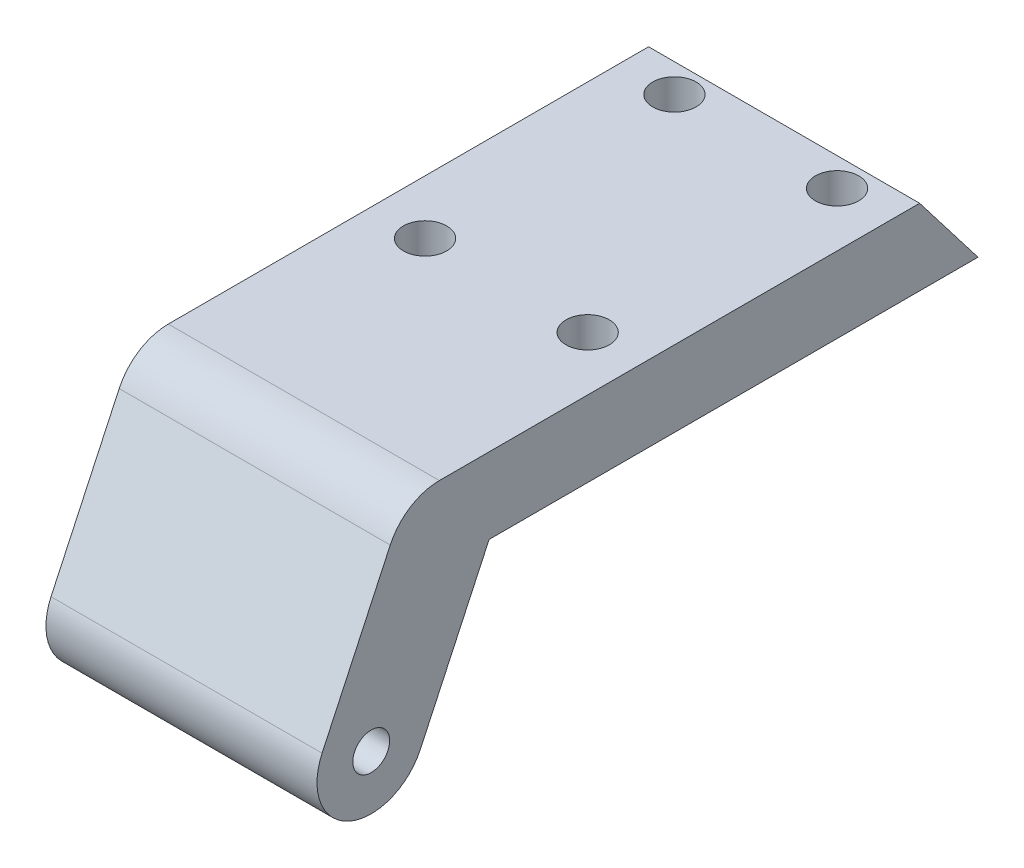
ISO-10303-21;
HEADER;
FILE_DESCRIPTION(('STEP AP214'),'2;1');
FILE_NAME('part.step','',(''),(''),'','','');
FILE_SCHEMA(('AUTOMOTIVE_DESIGN { 1 0 10303 214 1 1 1 1 }'));
ENDSEC;
DATA;
#1=APPLICATION_CONTEXT('core data for automotive mechanical design processes');
#2=APPLICATION_PROTOCOL_DEFINITION('international standard','automotive_design',2000,#1);
#3=PRODUCT_CONTEXT('',#1,'mechanical');
#4=PRODUCT('Part','Part','',(#3));
#5=PRODUCT_RELATED_PRODUCT_CATEGORY('part','',(#4));
#6=PRODUCT_DEFINITION_FORMATION('','',#4);
#7=PRODUCT_DEFINITION_CONTEXT('part definition',#1,'design');
#8=PRODUCT_DEFINITION('design','',#6,#7);
#9=PRODUCT_DEFINITION_SHAPE('','',#8);
#10=(LENGTH_UNIT() NAMED_UNIT(*) SI_UNIT(.MILLI.,.METRE.));
#11=(NAMED_UNIT(*) PLANE_ANGLE_UNIT() SI_UNIT($,.RADIAN.));
#12=(NAMED_UNIT(*) SI_UNIT($,.STERADIAN.) SOLID_ANGLE_UNIT());
#13=UNCERTAINTY_MEASURE_WITH_UNIT(LENGTH_MEASURE(1.E-05),#10,'distance_accuracy_value','');
#14=(GEOMETRIC_REPRESENTATION_CONTEXT(3) GLOBAL_UNCERTAINTY_ASSIGNED_CONTEXT((#13)) GLOBAL_UNIT_ASSIGNED_CONTEXT((#10,
#11,#12)) REPRESENTATION_CONTEXT('',''));
#15=CARTESIAN_POINT('',(0.,0.,0.));
#16=DIRECTION('',(0.,0.,1.));
#17=DIRECTION('',(1.,0.,0.));
#18=AXIS2_PLACEMENT_3D('',#15,#16,#17);
#19=CARTESIAN_POINT('',(1239.58557195285,7.,1588.21257215047));
#20=DIRECTION('',(1.,0.,0.));
#21=DIRECTION('',(0.,0.,-1.));
#22=AXIS2_PLACEMENT_3D('',#19,#20,#21);
#23=PLANE('',#22);
#24=DIRECTION('',(0.,-0.906307787036649,0.4226182617407));
#25=VECTOR('',#24,1.);
#26=CARTESIAN_POINT('',(1239.58557195285,7.,1647.09219773301));
#27=LINE('',#26,#25);
#28=CARTESIAN_POINT('',(1239.58557195285,4.11309130870354,1648.43838536415));
#29=VERTEX_POINT('',#28);
#30=CARTESIAN_POINT('',(1239.58557195285,-9.36843418814272,1654.72492394695));
#31=VERTEX_POINT('',#30);
#32=EDGE_CURVE('E94',#29,#31,#27,.T.);
#33=ORIENTED_EDGE('',*,*,#32,.F.);
#34=CARTESIAN_POINT('',(1239.58557195285,2.,1643.90684642897));
#35=DIRECTION('',(1.,0.,0.));
#36=DIRECTION('',(0.,0.,-1.));
#37=AXIS2_PLACEMENT_3D('',#34,#35,#36);
#38=CIRCLE('',#37,5.);
#39=CARTESIAN_POINT('',(1239.58557195285,7.,1643.90684642897));
#40=VERTEX_POINT('',#39);
#41=EDGE_CURVE('E11',#29,#40,#38,.F.);
#42=ORIENTED_EDGE('',*,*,#41,.T.);
#43=DIRECTION('',(0.,0.,1.));
#44=VECTOR('',#43,1.);
#45=CARTESIAN_POINT('',(1239.58557195285,7.,1588.21257215047));
#46=LINE('',#45,#44);
#47=CARTESIAN_POINT('',(1239.58557195285,7.,1599.61312730155));
#48=VERTEX_POINT('',#47);
#49=EDGE_CURVE('E155',#48,#40,#46,.T.);
#50=ORIENTED_EDGE('',*,*,#49,.F.);
#51=DIRECTION('',(0.,-0.792774884248765,-0.609514546917756));
#52=VECTOR('',#51,1.);
#53=CARTESIAN_POINT('',(1239.58557195285,1.49116254871517,1595.37773005338));
#54=LINE('',#53,#52);
#55=CARTESIAN_POINT('',(1239.58557195285,0.,1594.23126933254));
#56=VERTEX_POINT('',#55);
#57=EDGE_CURVE('E151',#48,#56,#54,.T.);
#58=ORIENTED_EDGE('',*,*,#57,.T.);
#59=DIRECTION('',(0.,0.,1.));
#60=VECTOR('',#59,1.);
#61=CARTESIAN_POINT('',(1239.58557195285,0.,1588.21257215047));
#62=LINE('',#61,#60);
#63=CARTESIAN_POINT('',(1239.58557195285,0.,1639.32257215047));
#64=VERTEX_POINT('',#63);
#65=EDGE_CURVE('E154',#56,#64,#62,.T.);
#66=ORIENTED_EDGE('',*,*,#65,.T.);
#67=DIRECTION('',(0.,0.906307787036648,-0.422618261740703));
#68=VECTOR('',#67,1.);
#69=CARTESIAN_POINT('',(1239.58557195285,-13.5946168055497,1645.66184607658));
#70=LINE('',#69,#68);
#71=CARTESIAN_POINT('',(1239.58557195285,-13.5946168055497,1645.66184607658));
#72=VERTEX_POINT('',#71);
#73=EDGE_CURVE('E112',#72,#64,#70,.T.);
#74=ORIENTED_EDGE('',*,*,#73,.F.);
#75=CARTESIAN_POINT('',(1239.58557195285,-11.4815254968463,1650.19338501176));
#76=DIRECTION('',(1.,0.,0.));
#77=DIRECTION('',(0.,0.,-1.));
#78=AXIS2_PLACEMENT_3D('',#75,#76,#77);
#79=CIRCLE('',#78,5.00000000000007);
#80=EDGE_CURVE('E102',#31,#72,#79,.T.);
#81=ORIENTED_EDGE('',*,*,#80,.F.);
#82=EDGE_LOOP('',(#33,#42,#50,#58,#66,#74,#81));
#83=FACE_BOUND('',#82,.T.);
#84=CARTESIAN_POINT('',(1239.58557195285,-11.4815254968463,1650.19338501176));
#85=DIRECTION('',(1.,0.,0.));
#86=DIRECTION('',(0.,0.,-1.));
#87=AXIS2_PLACEMENT_3D('',#84,#85,#86);
#88=CIRCLE('',#87,1.69999999999996);
#89=CARTESIAN_POINT('',(1239.58557195285,-11.4815254968463,1648.49338501176));
#90=VERTEX_POINT('',#89);
#91=EDGE_CURVE('E123',#90,#90,#88,.T.);
#92=ORIENTED_EDGE('',*,*,#91,.T.);
#93=EDGE_LOOP('',(#92));
#94=FACE_BOUND('',#93,.T.);
#95=ADVANCED_FACE('F39',(#83,#94),#23,.F.);
#96=CARTESIAN_POINT('',(1264.58557195285,7.,1588.21257215047));
#97=DIRECTION('',(-1.,0.,0.));
#98=DIRECTION('',(0.,0.,1.));
#99=AXIS2_PLACEMENT_3D('',#96,#97,#98);
#100=PLANE('',#99);
#101=DIRECTION('',(0.,0.,-1.));
#102=VECTOR('',#101,1.);
#103=CARTESIAN_POINT('',(1264.58557195285,7.,1588.21257215047));
#104=LINE('',#103,#102);
#105=CARTESIAN_POINT('',(1264.58557195285,7.,1643.90684642897));
#106=VERTEX_POINT('',#105);
#107=CARTESIAN_POINT('',(1264.58557195285,7.,1599.61312730155));
#108=VERTEX_POINT('',#107);
#109=EDGE_CURVE('E158',#106,#108,#104,.T.);
#110=ORIENTED_EDGE('',*,*,#109,.F.);
#111=CARTESIAN_POINT('',(1264.58557195285,2.,1643.90684642897));
#112=DIRECTION('',(-1.,0.,0.));
#113=DIRECTION('',(0.,0.,1.));
#114=AXIS2_PLACEMENT_3D('',#111,#112,#113);
#115=CIRCLE('',#114,5.);
#116=CARTESIAN_POINT('',(1264.58557195285,4.11309130870354,1648.43838536415));
#117=VERTEX_POINT('',#116);
#118=EDGE_CURVE('E61',#106,#117,#115,.F.);
#119=ORIENTED_EDGE('',*,*,#118,.T.);
#120=DIRECTION('',(0.,-0.906307787036649,0.4226182617407));
#121=VECTOR('',#120,1.);
#122=CARTESIAN_POINT('',(1264.58557195285,7.,1647.09219773301));
#123=LINE('',#122,#121);
#124=CARTESIAN_POINT('',(1264.58557195285,-9.36843418814272,1654.72492394695));
#125=VERTEX_POINT('',#124);
#126=EDGE_CURVE('E121',#117,#125,#123,.T.);
#127=ORIENTED_EDGE('',*,*,#126,.T.);
#128=CARTESIAN_POINT('',(1264.58557195285,-11.4815254968463,1650.19338501176));
#129=DIRECTION('',(1.,0.,0.));
#130=DIRECTION('',(0.,0.,-1.));
#131=AXIS2_PLACEMENT_3D('',#128,#129,#130);
#132=CIRCLE('',#131,5.00000000000007);
#133=CARTESIAN_POINT('',(1264.58557195285,-13.5946168055497,1645.66184607658));
#134=VERTEX_POINT('',#133);
#135=EDGE_CURVE('E110',#125,#134,#132,.T.);
#136=ORIENTED_EDGE('',*,*,#135,.T.);
#137=DIRECTION('',(0.,0.906307787036648,-0.422618261740703));
#138=VECTOR('',#137,1.);
#139=CARTESIAN_POINT('',(1264.58557195285,-13.5946168055497,1645.66184607658));
#140=LINE('',#139,#138);
#141=CARTESIAN_POINT('',(1264.58557195285,0.,1639.32257215047));
#142=VERTEX_POINT('',#141);
#143=EDGE_CURVE('E103',#134,#142,#140,.T.);
#144=ORIENTED_EDGE('',*,*,#143,.T.);
#145=DIRECTION('',(0.,0.,-1.));
#146=VECTOR('',#145,1.);
#147=CARTESIAN_POINT('',(1264.58557195285,0.,1588.21257215047));
#148=LINE('',#147,#146);
#149=CARTESIAN_POINT('',(1264.58557195285,0.,1594.23126933254));
#150=VERTEX_POINT('',#149);
#151=EDGE_CURVE('E159',#142,#150,#148,.T.);
#152=ORIENTED_EDGE('',*,*,#151,.T.);
#153=DIRECTION('',(0.,-0.792774884248765,-0.609514546917756));
#154=VECTOR('',#153,1.);
#155=CARTESIAN_POINT('',(1264.58557195285,0.,1594.23126933254));
#156=LINE('',#155,#154);
#157=EDGE_CURVE('E144',#108,#150,#156,.T.);
#158=ORIENTED_EDGE('',*,*,#157,.F.);
#159=EDGE_LOOP('',(#110,#119,#127,#136,#144,#152,#158));
#160=FACE_BOUND('',#159,.T.);
#161=CARTESIAN_POINT('',(1264.58557195285,-11.4815254968463,1650.19338501176));
#162=DIRECTION('',(1.,0.,0.));
#163=DIRECTION('',(0.,0.,-1.));
#164=AXIS2_PLACEMENT_3D('',#161,#162,#163);
#165=CIRCLE('',#164,1.69999999999996);
#166=CARTESIAN_POINT('',(1264.58557195285,-11.4815254968463,1648.49338501176));
#167=VERTEX_POINT('',#166);
#168=EDGE_CURVE('E362',#167,#167,#165,.T.);
#169=ORIENTED_EDGE('',*,*,#168,.F.);
#170=EDGE_LOOP('',(#169));
#171=FACE_BOUND('',#170,.T.);
#172=ADVANCED_FACE('F186',(#160,#171),#100,.F.);
#173=CARTESIAN_POINT('',(0.,7.,0.));
#174=DIRECTION('',(0.,1.,0.));
#175=DIRECTION('',(0.,0.,1.));
#176=AXIS2_PLACEMENT_3D('',#173,#174,#175);
#177=PLANE('',#176);
#178=CARTESIAN_POINT('',(1259.58557195285,7.,1625.23126933254));
#179=DIRECTION('',(0.,1.,0.));
#180=DIRECTION('',(0.,0.,1.));
#181=AXIS2_PLACEMENT_3D('',#178,#179,#180);
#182=CIRCLE('',#181,1.99999999999989);
#183=CARTESIAN_POINT('',(1259.58557195285,7.,1627.23126933254));
#184=VERTEX_POINT('',#183);
#185=EDGE_CURVE('E135',#184,#184,#182,.T.);
#186=ORIENTED_EDGE('',*,*,#185,.F.);
#187=EDGE_LOOP('',(#186));
#188=FACE_BOUND('',#187,.T.);
#189=CARTESIAN_POINT('',(1244.58557195285,7.,1602.23126933254));
#190=DIRECTION('',(0.,1.,0.));
#191=DIRECTION('',(0.,0.,1.));
#192=AXIS2_PLACEMENT_3D('',#189,#190,#191);
#193=CIRCLE('',#192,1.99999999999989);
#194=CARTESIAN_POINT('',(1244.58557195285,7.,1604.23126933254));
#195=VERTEX_POINT('',#194);
#196=EDGE_CURVE('E134',#195,#195,#193,.T.);
#197=ORIENTED_EDGE('',*,*,#196,.F.);
#198=EDGE_LOOP('',(#197));
#199=FACE_BOUND('',#198,.T.);
#200=CARTESIAN_POINT('',(1244.58557195285,7.,1625.23126933254));
#201=DIRECTION('',(0.,1.,0.));
#202=DIRECTION('',(0.,0.,1.));
#203=AXIS2_PLACEMENT_3D('',#200,#201,#202);
#204=CIRCLE('',#203,1.99999999999989);
#205=CARTESIAN_POINT('',(1244.58557195285,7.,1627.23126933254));
#206=VERTEX_POINT('',#205);
#207=EDGE_CURVE('E130',#206,#206,#204,.T.);
#208=ORIENTED_EDGE('',*,*,#207,.F.);
#209=EDGE_LOOP('',(#208));
#210=FACE_BOUND('',#209,.T.);
#211=CARTESIAN_POINT('',(1259.58557195285,7.,1602.23126933254));
#212=DIRECTION('',(0.,1.,0.));
#213=DIRECTION('',(0.,0.,1.));
#214=AXIS2_PLACEMENT_3D('',#211,#212,#213);
#215=CIRCLE('',#214,1.99999999999989);
#216=CARTESIAN_POINT('',(1259.58557195285,7.,1604.23126933254));
#217=VERTEX_POINT('',#216);
#218=EDGE_CURVE('E138',#217,#217,#215,.T.);
#219=ORIENTED_EDGE('',*,*,#218,.F.);
#220=EDGE_LOOP('',(#219));
#221=FACE_BOUND('',#220,.T.);
#222=ORIENTED_EDGE('',*,*,#49,.T.);
#223=DIRECTION('',(1.,0.,0.));
#224=VECTOR('',#223,1.);
#225=CARTESIAN_POINT('',(0.,7.,1643.90684642897));
#226=LINE('',#225,#224);
#227=EDGE_CURVE('E166',#40,#106,#226,.T.);
#228=ORIENTED_EDGE('',*,*,#227,.T.);
#229=ORIENTED_EDGE('',*,*,#109,.T.);
#230=DIRECTION('',(1.,0.,0.));
#231=VECTOR('',#230,1.);
#232=CARTESIAN_POINT('',(1199.58557195285,7.,1599.61312730155));
#233=LINE('',#232,#231);
#234=EDGE_CURVE('E147',#48,#108,#233,.T.);
#235=ORIENTED_EDGE('',*,*,#234,.F.);
#236=EDGE_LOOP('',(#222,#228,#229,#235));
#237=FACE_BOUND('',#236,.T.);
#238=ADVANCED_FACE('F181',(#188,#199,#210,#221,#237),#177,.T.);
#239=CARTESIAN_POINT('',(0.,0.,0.));
#240=DIRECTION('',(0.,1.,0.));
#241=DIRECTION('',(0.,0.,1.));
#242=AXIS2_PLACEMENT_3D('',#239,#240,#241);
#243=PLANE('',#242);
#244=CARTESIAN_POINT('',(1259.58557195285,0.,1625.23126933254));
#245=DIRECTION('',(0.,1.,0.));
#246=DIRECTION('',(0.,0.,1.));
#247=AXIS2_PLACEMENT_3D('',#244,#245,#246);
#248=CIRCLE('',#247,1.99999999999989);
#249=CARTESIAN_POINT('',(1259.58557195285,0.,1627.23126933254));
#250=VERTEX_POINT('',#249);
#251=EDGE_CURVE('E148',#250,#250,#248,.T.);
#252=ORIENTED_EDGE('',*,*,#251,.T.);
#253=EDGE_LOOP('',(#252));
#254=FACE_BOUND('',#253,.T.);
#255=CARTESIAN_POINT('',(1244.58557195285,0.,1602.23126933254));
#256=DIRECTION('',(0.,1.,0.));
#257=DIRECTION('',(0.,0.,1.));
#258=AXIS2_PLACEMENT_3D('',#255,#256,#257);
#259=CIRCLE('',#258,1.99999999999989);
#260=CARTESIAN_POINT('',(1244.58557195285,0.,1604.23126933254));
#261=VERTEX_POINT('',#260);
#262=EDGE_CURVE('E172',#261,#261,#259,.T.);
#263=ORIENTED_EDGE('',*,*,#262,.T.);
#264=EDGE_LOOP('',(#263));
#265=FACE_BOUND('',#264,.T.);
#266=CARTESIAN_POINT('',(1244.58557195285,0.,1625.23126933254));
#267=DIRECTION('',(0.,1.,0.));
#268=DIRECTION('',(0.,0.,1.));
#269=AXIS2_PLACEMENT_3D('',#266,#267,#268);
#270=CIRCLE('',#269,1.99999999999989);
#271=CARTESIAN_POINT('',(1244.58557195285,0.,1627.23126933254));
#272=VERTEX_POINT('',#271);
#273=EDGE_CURVE('E169',#272,#272,#270,.T.);
#274=ORIENTED_EDGE('',*,*,#273,.T.);
#275=EDGE_LOOP('',(#274));
#276=FACE_BOUND('',#275,.T.);
#277=CARTESIAN_POINT('',(1259.58557195285,0.,1602.23126933254));
#278=DIRECTION('',(0.,1.,0.));
#279=DIRECTION('',(0.,0.,1.));
#280=AXIS2_PLACEMENT_3D('',#277,#278,#279);
#281=CIRCLE('',#280,1.99999999999989);
#282=CARTESIAN_POINT('',(1259.58557195285,0.,1604.23126933254));
#283=VERTEX_POINT('',#282);
#284=EDGE_CURVE('E143',#283,#283,#281,.T.);
#285=ORIENTED_EDGE('',*,*,#284,.T.);
#286=EDGE_LOOP('',(#285));
#287=FACE_BOUND('',#286,.T.);
#288=ORIENTED_EDGE('',*,*,#151,.F.);
#289=DIRECTION('',(1.,0.,0.));
#290=VECTOR('',#289,1.);
#291=CARTESIAN_POINT('',(1239.58557195285,0.,1639.32257215047));
#292=LINE('',#291,#290);
#293=EDGE_CURVE('E127',#64,#142,#292,.T.);
#294=ORIENTED_EDGE('',*,*,#293,.F.);
#295=ORIENTED_EDGE('',*,*,#65,.F.);
#296=DIRECTION('',(1.,0.,0.));
#297=VECTOR('',#296,1.);
#298=CARTESIAN_POINT('',(0.,0.,1594.23126933254));
#299=LINE('',#298,#297);
#300=EDGE_CURVE('E161',#56,#150,#299,.T.);
#301=ORIENTED_EDGE('',*,*,#300,.T.);
#302=EDGE_LOOP('',(#288,#294,#295,#301));
#303=FACE_BOUND('',#302,.T.);
#304=ADVANCED_FACE('F192',(#254,#265,#276,#287,#303),#243,.F.);
#305=CARTESIAN_POINT('',(1199.58557195285,0.,1594.23126933254));
#306=DIRECTION('',(0.,-0.609514546917756,0.792774884248765));
#307=DIRECTION('',(0.,-0.792774884248765,-0.609514546917756));
#308=AXIS2_PLACEMENT_3D('',#305,#306,#307);
#309=PLANE('',#308);
#310=ORIENTED_EDGE('',*,*,#234,.T.);
#311=ORIENTED_EDGE('',*,*,#157,.T.);
#312=ORIENTED_EDGE('',*,*,#300,.F.);
#313=ORIENTED_EDGE('',*,*,#57,.F.);
#314=EDGE_LOOP('',(#310,#311,#312,#313));
#315=FACE_BOUND('',#314,.T.);
#316=ADVANCED_FACE('F189',(#315),#309,.F.);
#317=CARTESIAN_POINT('',(1259.58557195285,-58.,1602.23126933254));
#318=DIRECTION('',(0.,1.,0.));
#319=DIRECTION('',(0.,0.,1.));
#320=AXIS2_PLACEMENT_3D('',#317,#318,#319);
#321=CYLINDRICAL_SURFACE('',#320,1.99999999999989);
#322=ORIENTED_EDGE('',*,*,#218,.T.);
#323=EDGE_LOOP('',(#322));
#324=FACE_BOUND('',#323,.T.);
#325=ORIENTED_EDGE('',*,*,#284,.F.);
#326=EDGE_LOOP('',(#325));
#327=FACE_BOUND('',#326,.T.);
#328=ADVANCED_FACE('F218',(#324,#327),#321,.F.);
#329=CARTESIAN_POINT('',(1244.58557195285,-58.,1625.23126933254));
#330=DIRECTION('',(0.,1.,0.));
#331=DIRECTION('',(0.,0.,1.));
#332=AXIS2_PLACEMENT_3D('',#329,#330,#331);
#333=CYLINDRICAL_SURFACE('',#332,1.99999999999989);
#334=ORIENTED_EDGE('',*,*,#207,.T.);
#335=EDGE_LOOP('',(#334));
#336=FACE_BOUND('',#335,.T.);
#337=ORIENTED_EDGE('',*,*,#273,.F.);
#338=EDGE_LOOP('',(#337));
#339=FACE_BOUND('',#338,.T.);
#340=ADVANCED_FACE('F221',(#336,#339),#333,.F.);
#341=CARTESIAN_POINT('',(1244.58557195285,-58.,1602.23126933254));
#342=DIRECTION('',(0.,1.,0.));
#343=DIRECTION('',(0.,0.,1.));
#344=AXIS2_PLACEMENT_3D('',#341,#342,#343);
#345=CYLINDRICAL_SURFACE('',#344,1.99999999999989);
#346=ORIENTED_EDGE('',*,*,#196,.T.);
#347=EDGE_LOOP('',(#346));
#348=FACE_BOUND('',#347,.T.);
#349=ORIENTED_EDGE('',*,*,#262,.F.);
#350=EDGE_LOOP('',(#349));
#351=FACE_BOUND('',#350,.T.);
#352=ADVANCED_FACE('F223',(#348,#351),#345,.F.);
#353=CARTESIAN_POINT('',(1259.58557195285,-58.,1625.23126933254));
#354=DIRECTION('',(0.,1.,0.));
#355=DIRECTION('',(0.,0.,1.));
#356=AXIS2_PLACEMENT_3D('',#353,#354,#355);
#357=CYLINDRICAL_SURFACE('',#356,1.99999999999989);
#358=ORIENTED_EDGE('',*,*,#185,.T.);
#359=EDGE_LOOP('',(#358));
#360=FACE_BOUND('',#359,.T.);
#361=ORIENTED_EDGE('',*,*,#251,.F.);
#362=EDGE_LOOP('',(#361));
#363=FACE_BOUND('',#362,.T.);
#364=ADVANCED_FACE('F226',(#360,#363),#357,.F.);
#365=CARTESIAN_POINT('',(1239.58557195285,-13.5946168055497,1645.66184607658));
#366=DIRECTION('',(0.,-0.422618261740703,-0.906307787036648));
#367=DIRECTION('',(0.,0.906307787036648,-0.422618261740704));
#368=AXIS2_PLACEMENT_3D('',#365,#366,#367);
#369=PLANE('',#368);
#370=ORIENTED_EDGE('',*,*,#143,.F.);
#371=DIRECTION('',(1.,0.,0.));
#372=VECTOR('',#371,1.);
#373=CARTESIAN_POINT('',(1239.58557195285,-13.5946168055497,1645.66184607658));
#374=LINE('',#373,#372);
#375=EDGE_CURVE('E111',#72,#134,#374,.T.);
#376=ORIENTED_EDGE('',*,*,#375,.F.);
#377=ORIENTED_EDGE('',*,*,#73,.T.);
#378=ORIENTED_EDGE('',*,*,#293,.T.);
#379=EDGE_LOOP('',(#370,#376,#377,#378));
#380=FACE_BOUND('',#379,.T.);
#381=ADVANCED_FACE('F195',(#380),#369,.T.);
#382=CARTESIAN_POINT('',(1239.58557195285,-11.4815254968463,1650.19338501176));
#383=DIRECTION('',(1.,0.,0.));
#384=DIRECTION('',(0.,0.,-1.));
#385=AXIS2_PLACEMENT_3D('',#382,#383,#384);
#386=CYLINDRICAL_SURFACE('',#385,5.00000000000007);
#387=ORIENTED_EDGE('',*,*,#135,.F.);
#388=DIRECTION('',(1.,0.,0.));
#389=VECTOR('',#388,1.);
#390=CARTESIAN_POINT('',(1239.58557195285,-9.36843418814272,1654.72492394695));
#391=LINE('',#390,#389);
#392=EDGE_CURVE('E97',#31,#125,#391,.T.);
#393=ORIENTED_EDGE('',*,*,#392,.F.);
#394=ORIENTED_EDGE('',*,*,#80,.T.);
#395=ORIENTED_EDGE('',*,*,#375,.T.);
#396=EDGE_LOOP('',(#387,#393,#394,#395));
#397=FACE_BOUND('',#396,.T.);
#398=ADVANCED_FACE('F107',(#397),#386,.T.);
#399=CARTESIAN_POINT('',(1239.58557195285,7.,1647.09219773301));
#400=DIRECTION('',(0.,0.4226182617407,0.906307787036649));
#401=DIRECTION('',(0.,-0.906307787036649,0.4226182617407));
#402=AXIS2_PLACEMENT_3D('',#399,#400,#401);
#403=PLANE('',#402);
#404=ORIENTED_EDGE('',*,*,#126,.F.);
#405=DIRECTION('',(1.,0.,0.));
#406=VECTOR('',#405,1.);
#407=CARTESIAN_POINT('',(1239.58557195285,4.11309130870355,1648.43838536415));
#408=LINE('',#407,#406);
#409=EDGE_CURVE('E47',#117,#29,#408,.F.);
#410=ORIENTED_EDGE('',*,*,#409,.T.);
#411=ORIENTED_EDGE('',*,*,#32,.T.);
#412=ORIENTED_EDGE('',*,*,#392,.T.);
#413=EDGE_LOOP('',(#404,#410,#411,#412));
#414=FACE_BOUND('',#413,.T.);
#415=ADVANCED_FACE('F96',(#414),#403,.T.);
#416=CARTESIAN_POINT('',(1239.58557195285,-11.4815254968463,1650.19338501176));
#417=DIRECTION('',(1.,0.,0.));
#418=DIRECTION('',(0.,0.,-1.));
#419=AXIS2_PLACEMENT_3D('',#416,#417,#418);
#420=CYLINDRICAL_SURFACE('',#419,1.69999999999996);
#421=ORIENTED_EDGE('',*,*,#91,.F.);
#422=EDGE_LOOP('',(#421));
#423=FACE_BOUND('',#422,.T.);
#424=ORIENTED_EDGE('',*,*,#168,.T.);
#425=EDGE_LOOP('',(#424));
#426=FACE_BOUND('',#425,.T.);
#427=ADVANCED_FACE('F197',(#423,#426),#420,.F.);
#428=CARTESIAN_POINT('',(0.,2.,1643.90684642897));
#429=DIRECTION('',(1.,0.,0.));
#430=DIRECTION('',(0.,0.,-1.));
#431=AXIS2_PLACEMENT_3D('',#428,#429,#430);
#432=CYLINDRICAL_SURFACE('',#431,5.);
#433=ORIENTED_EDGE('',*,*,#41,.F.);
#434=ORIENTED_EDGE('',*,*,#409,.F.);
#435=ORIENTED_EDGE('',*,*,#118,.F.);
#436=ORIENTED_EDGE('',*,*,#227,.F.);
#437=EDGE_LOOP('',(#433,#434,#435,#436));
#438=FACE_BOUND('',#437,.T.);
#439=ADVANCED_FACE('F41',(#438),#432,.T.);
#440=CLOSED_SHELL('',(#95,#172,#238,#304,#316,#328,#340,#352,#364,#381,#398,#415,#427,#439));
#441=MANIFOLD_SOLID_BREP('B2',#440);
#442=ADVANCED_BREP_SHAPE_REPRESENTATION('',(#18,#441),#14);
#443=SHAPE_DEFINITION_REPRESENTATION(#9,#442);
ENDSEC;
END-ISO-10303-21;
